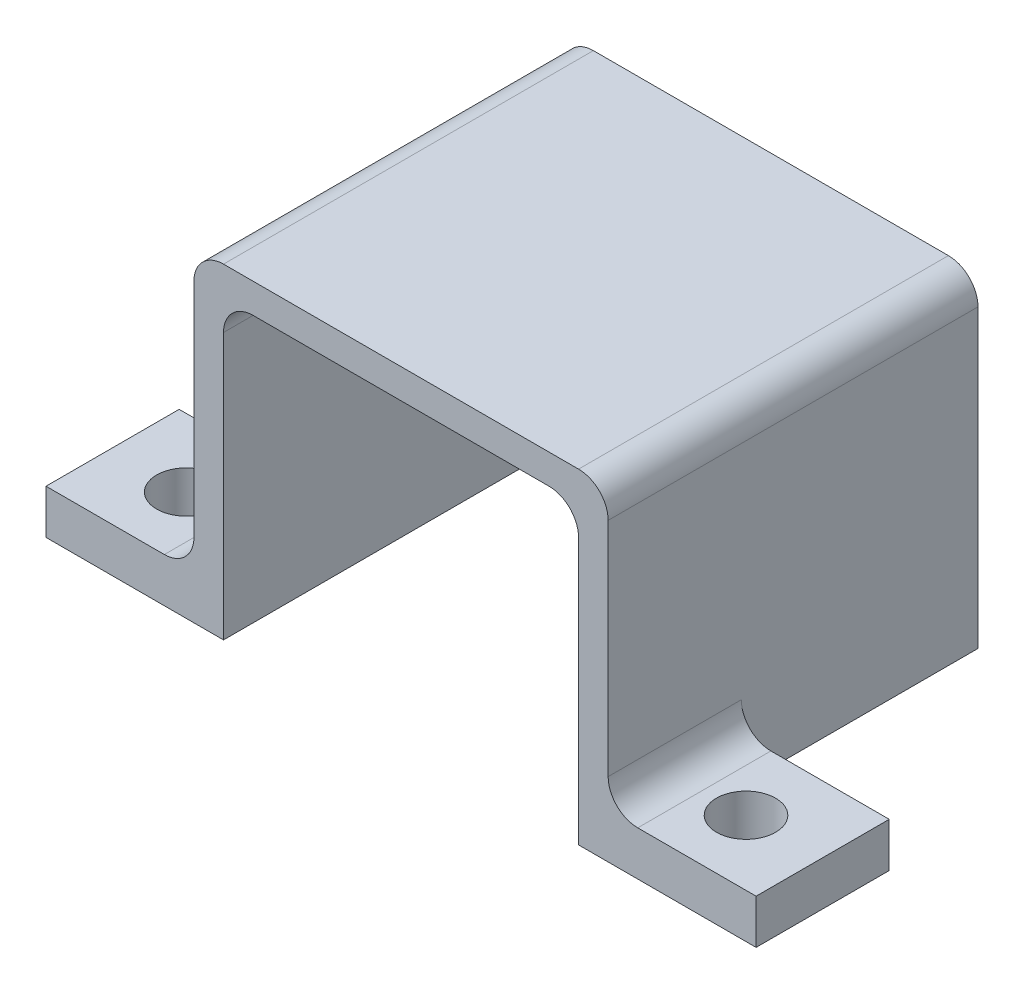
ISO-10303-21;
HEADER;
FILE_DESCRIPTION(('STEP AP214'),'2;1');
FILE_NAME('part.step','',(''),(''),'','','');
FILE_SCHEMA(('AUTOMOTIVE_DESIGN { 1 0 10303 214 1 1 1 1 }'));
ENDSEC;
DATA;
#1=APPLICATION_CONTEXT('core data for automotive mechanical design processes');
#2=APPLICATION_PROTOCOL_DEFINITION('international standard','automotive_design',2000,#1);
#3=PRODUCT_CONTEXT('',#1,'mechanical');
#4=PRODUCT('Part','Part','',(#3));
#5=PRODUCT_RELATED_PRODUCT_CATEGORY('part','',(#4));
#6=PRODUCT_DEFINITION_FORMATION('','',#4);
#7=PRODUCT_DEFINITION_CONTEXT('part definition',#1,'design');
#8=PRODUCT_DEFINITION('design','',#6,#7);
#9=PRODUCT_DEFINITION_SHAPE('','',#8);
#10=(LENGTH_UNIT() NAMED_UNIT(*) SI_UNIT(.MILLI.,.METRE.));
#11=(NAMED_UNIT(*) PLANE_ANGLE_UNIT() SI_UNIT($,.RADIAN.));
#12=(NAMED_UNIT(*) SI_UNIT($,.STERADIAN.) SOLID_ANGLE_UNIT());
#13=UNCERTAINTY_MEASURE_WITH_UNIT(LENGTH_MEASURE(1.E-05),#10,'distance_accuracy_value','');
#14=(GEOMETRIC_REPRESENTATION_CONTEXT(3) GLOBAL_UNCERTAINTY_ASSIGNED_CONTEXT((#13)) GLOBAL_UNIT_ASSIGNED_CONTEXT((#10,
#11,#12)) REPRESENTATION_CONTEXT('',''));
#15=CARTESIAN_POINT('',(0.,0.,0.));
#16=DIRECTION('',(0.,0.,1.));
#17=DIRECTION('',(1.,0.,0.));
#18=AXIS2_PLACEMENT_3D('',#15,#16,#17);
#19=CARTESIAN_POINT('',(0.,24.2221183459129,0.));
#20=DIRECTION('',(0.,1.,0.));
#21=DIRECTION('',(0.,0.,1.));
#22=AXIS2_PLACEMENT_3D('',#19,#20,#21);
#23=PLANE('',#22);
#24=DIRECTION('',(1.,0.,0.));
#25=VECTOR('',#24,1.);
#26=CARTESIAN_POINT('',(8.51904319018354,24.2221183459129,28.3904073622046));
#27=LINE('',#26,#25);
#28=CARTESIAN_POINT('',(8.51904319018354,24.2221183459129,28.3904073622046));
#29=VERTEX_POINT('',#28);
#30=CARTESIAN_POINT('',(17.1865680248929,24.2221183459129,28.3904073622046));
#31=VERTEX_POINT('',#30);
#32=EDGE_CURVE('E429',#29,#31,#27,.T.);
#33=ORIENTED_EDGE('',*,*,#32,.T.);
#34=DIRECTION('',(0.,0.,1.));
#35=VECTOR('',#34,1.);
#36=CARTESIAN_POINT('',(17.1865680248929,24.2221183459129,29.5904073622046));
#37=LINE('',#36,#35);
#38=CARTESIAN_POINT('',(17.1865680248929,24.2221183459129,30.7904073622046));
#39=VERTEX_POINT('',#38);
#40=EDGE_CURVE('E287',#31,#39,#37,.T.);
#41=ORIENTED_EDGE('',*,*,#40,.T.);
#42=DIRECTION('',(-1.,0.,0.));
#43=VECTOR('',#42,1.);
#44=CARTESIAN_POINT('',(8.51904319018354,24.2221183459129,30.7904073622046));
#45=LINE('',#44,#43);
#46=CARTESIAN_POINT('',(8.51904319018354,24.2221183459129,30.7904073622046));
#47=VERTEX_POINT('',#46);
#48=EDGE_CURVE('E435',#39,#47,#45,.T.);
#49=ORIENTED_EDGE('',*,*,#48,.T.);
#50=DIRECTION('',(0.,0.,-1.));
#51=VECTOR('',#50,1.);
#52=CARTESIAN_POINT('',(8.51904319018354,24.2221183459129,28.3904073622046));
#53=LINE('',#52,#51);
#54=EDGE_CURVE('E424',#47,#29,#53,.T.);
#55=ORIENTED_EDGE('',*,*,#54,.T.);
#56=EDGE_LOOP('',(#33,#41,#49,#55));
#57=FACE_BOUND('',#56,.T.);
#58=ADVANCED_FACE('F38',(#57),#23,.F.);
#59=CARTESIAN_POINT('',(8.51904319018354,25.2221183459129,1.18964979731646));
#60=DIRECTION('',(0.,-1.,0.));
#61=DIRECTION('',(0.,0.,-1.));
#62=AXIS2_PLACEMENT_3D('',#59,#60,#61);
#63=PLANE('',#62);
#64=DIRECTION('',(0.,0.,1.));
#65=VECTOR('',#64,1.);
#66=CARTESIAN_POINT('',(9.51904319018354,25.2221183459129,27.5904073622046));
#67=LINE('',#66,#65);
#68=CARTESIAN_POINT('',(9.51904319018354,25.2221183459129,28.3904073622046));
#69=VERTEX_POINT('',#68);
#70=CARTESIAN_POINT('',(9.51904319018354,25.2221183459129,27.5904073622046));
#71=VERTEX_POINT('',#70);
#72=EDGE_CURVE('E256',#69,#71,#67,.F.);
#73=ORIENTED_EDGE('',*,*,#72,.T.);
#74=DIRECTION('',(-1.,0.,0.));
#75=VECTOR('',#74,1.);
#76=CARTESIAN_POINT('',(8.51904319018354,25.2221183459129,27.5904073622046));
#77=LINE('',#76,#75);
#78=CARTESIAN_POINT('',(19.5190431901835,25.2221183459129,27.5904073622046));
#79=VERTEX_POINT('',#78);
#80=EDGE_CURVE('E237',#79,#71,#77,.T.);
#81=ORIENTED_EDGE('',*,*,#80,.F.);
#82=DIRECTION('',(0.,0.,1.));
#83=VECTOR('',#82,1.);
#84=CARTESIAN_POINT('',(19.5190431901835,25.2221183459129,40.0904073622046));
#85=LINE('',#84,#83);
#86=CARTESIAN_POINT('',(19.5190431901835,25.2221183459129,28.3904073622046));
#87=VERTEX_POINT('',#86);
#88=EDGE_CURVE('E261',#79,#87,#85,.T.);
#89=ORIENTED_EDGE('',*,*,#88,.T.);
#90=DIRECTION('',(1.,0.,0.));
#91=VECTOR('',#90,1.);
#92=CARTESIAN_POINT('',(8.51904319018354,25.2221183459129,28.3904073622046));
#93=LINE('',#92,#91);
#94=EDGE_CURVE('E423',#69,#87,#93,.T.);
#95=ORIENTED_EDGE('',*,*,#94,.F.);
#96=EDGE_LOOP('',(#73,#81,#89,#95));
#97=FACE_BOUND('',#96,.T.);
#98=ADVANCED_FACE('F470',(#97),#63,.T.);
#99=CARTESIAN_POINT('',(19.5190431901835,25.2221183459129,30.7904073622046));
#100=VERTEX_POINT('',#99);
#101=CARTESIAN_POINT('',(19.5190431901835,25.2221183459129,40.0904073622046));
#102=VERTEX_POINT('',#101);
#103=EDGE_CURVE('E260',#100,#102,#85,.T.);
#104=ORIENTED_EDGE('',*,*,#103,.T.);
#105=DIRECTION('',(1.,0.,0.));
#106=VECTOR('',#105,1.);
#107=CARTESIAN_POINT('',(8.51904319018354,25.2221183459129,40.0904073622046));
#108=LINE('',#107,#106);
#109=CARTESIAN_POINT('',(9.51904319018354,25.2221183459129,40.0904073622046));
#110=VERTEX_POINT('',#109);
#111=EDGE_CURVE('E353',#110,#102,#108,.T.);
#112=ORIENTED_EDGE('',*,*,#111,.F.);
#113=CARTESIAN_POINT('',(9.51904319018354,25.2221183459129,30.7904073622046));
#114=VERTEX_POINT('',#113);
#115=EDGE_CURVE('E258',#110,#114,#67,.F.);
#116=ORIENTED_EDGE('',*,*,#115,.T.);
#117=DIRECTION('',(-1.,0.,0.));
#118=VECTOR('',#117,1.);
#119=CARTESIAN_POINT('',(8.51904319018354,25.2221183459129,30.7904073622046));
#120=LINE('',#119,#118);
#121=EDGE_CURVE('E428',#100,#114,#120,.T.);
#122=ORIENTED_EDGE('',*,*,#121,.F.);
#123=EDGE_LOOP('',(#104,#112,#116,#122));
#124=FACE_BOUND('',#123,.T.);
#125=ADVANCED_FACE('F491',(#124),#63,.T.);
#126=CARTESIAN_POINT('',(19.5190431901835,24.2221183459129,1.18964979731646));
#127=DIRECTION('',(0.,0.,-1.));
#128=DIRECTION('',(-1.,0.,0.));
#129=AXIS2_PLACEMENT_3D('',#126,#127,#128);
#130=CYLINDRICAL_SURFACE('',#129,1.);
#131=CARTESIAN_POINT('',(19.5190431901835,24.2221183459129,28.3904073622046));
#132=DIRECTION('',(0.,0.,1.));
#133=DIRECTION('',(1.,0.,0.));
#134=AXIS2_PLACEMENT_3D('',#131,#132,#133);
#135=CIRCLE('',#134,1.);
#136=CARTESIAN_POINT('',(20.5190431901835,24.2221183459129,28.3904073622046));
#137=VERTEX_POINT('',#136);
#138=EDGE_CURVE('E444',#87,#137,#135,.F.);
#139=ORIENTED_EDGE('',*,*,#138,.F.);
#140=ORIENTED_EDGE('',*,*,#88,.F.);
#141=CARTESIAN_POINT('',(19.5190431901835,24.2221183459129,27.5904073622046));
#142=DIRECTION('',(0.,0.,1.));
#143=DIRECTION('',(1.,0.,0.));
#144=AXIS2_PLACEMENT_3D('',#141,#142,#143);
#145=CIRCLE('',#144,1.);
#146=CARTESIAN_POINT('',(20.5190431901835,24.2221183459129,27.5904073622046));
#147=VERTEX_POINT('',#146);
#148=EDGE_CURVE('E273',#147,#79,#145,.T.);
#149=ORIENTED_EDGE('',*,*,#148,.F.);
#150=DIRECTION('',(0.,0.,1.));
#151=VECTOR('',#150,1.);
#152=CARTESIAN_POINT('',(20.5190431901835,24.2221183459129,27.5904073622046));
#153=LINE('',#152,#151);
#154=EDGE_CURVE('E264',#137,#147,#153,.F.);
#155=ORIENTED_EDGE('',*,*,#154,.F.);
#156=EDGE_LOOP('',(#139,#140,#149,#155));
#157=FACE_BOUND('',#156,.T.);
#158=ADVANCED_FACE('F466',(#157),#130,.F.);
#159=CARTESIAN_POINT('',(19.5190431901835,24.2221183459129,30.7904073622046));
#160=DIRECTION('',(0.,0.,-1.));
#161=DIRECTION('',(-1.,0.,0.));
#162=AXIS2_PLACEMENT_3D('',#159,#160,#161);
#163=CIRCLE('',#162,1.);
#164=CARTESIAN_POINT('',(20.5190431901835,24.2221183459129,30.7904073622046));
#165=VERTEX_POINT('',#164);
#166=EDGE_CURVE('E439',#165,#100,#163,.F.);
#167=ORIENTED_EDGE('',*,*,#166,.F.);
#168=CARTESIAN_POINT('',(20.5190431901835,24.2221183459129,40.0904073622046));
#169=VERTEX_POINT('',#168);
#170=EDGE_CURVE('E265',#169,#165,#153,.F.);
#171=ORIENTED_EDGE('',*,*,#170,.F.);
#172=CARTESIAN_POINT('',(19.5190431901835,24.2221183459129,40.0904073622046));
#173=DIRECTION('',(0.,0.,1.));
#174=DIRECTION('',(1.,0.,0.));
#175=AXIS2_PLACEMENT_3D('',#172,#173,#174);
#176=CIRCLE('',#175,1.);
#177=EDGE_CURVE('E271',#102,#169,#176,.F.);
#178=ORIENTED_EDGE('',*,*,#177,.F.);
#179=ORIENTED_EDGE('',*,*,#103,.F.);
#180=EDGE_LOOP('',(#167,#171,#178,#179));
#181=FACE_BOUND('',#180,.T.);
#182=ADVANCED_FACE('F497',(#181),#130,.F.);
#183=CARTESIAN_POINT('',(9.51904319018354,24.2221183459129,1.18964979731646));
#184=DIRECTION('',(0.,0.,-1.));
#185=DIRECTION('',(-1.,0.,0.));
#186=AXIS2_PLACEMENT_3D('',#183,#184,#185);
#187=CYLINDRICAL_SURFACE('',#186,1.);
#188=CARTESIAN_POINT('',(9.51904319018354,24.2221183459129,28.3904073622046));
#189=DIRECTION('',(0.,0.,1.));
#190=DIRECTION('',(1.,0.,0.));
#191=AXIS2_PLACEMENT_3D('',#188,#189,#190);
#192=CIRCLE('',#191,1.);
#193=EDGE_CURVE('E282',#29,#69,#192,.F.);
#194=ORIENTED_EDGE('',*,*,#193,.F.);
#195=DIRECTION('',(0.,0.,1.));
#196=VECTOR('',#195,1.);
#197=CARTESIAN_POINT('',(8.51904319018354,24.2221183459129,40.0904073622046));
#198=LINE('',#197,#196);
#199=CARTESIAN_POINT('',(8.51904319018354,24.2221183459129,27.5904073622046));
#200=VERTEX_POINT('',#199);
#201=EDGE_CURVE('E268',#200,#29,#198,.T.);
#202=ORIENTED_EDGE('',*,*,#201,.F.);
#203=CARTESIAN_POINT('',(9.51904319018354,24.2221183459129,27.5904073622046));
#204=DIRECTION('',(0.,0.,1.));
#205=DIRECTION('',(1.,0.,0.));
#206=AXIS2_PLACEMENT_3D('',#203,#204,#205);
#207=CIRCLE('',#206,1.);
#208=EDGE_CURVE('E277',#71,#200,#207,.T.);
#209=ORIENTED_EDGE('',*,*,#208,.F.);
#210=ORIENTED_EDGE('',*,*,#72,.F.);
#211=EDGE_LOOP('',(#194,#202,#209,#210));
#212=FACE_BOUND('',#211,.T.);
#213=ADVANCED_FACE('F476',(#212),#187,.F.);
#214=CARTESIAN_POINT('',(9.51904319018354,24.2221183459129,30.7904073622046));
#215=DIRECTION('',(0.,0.,-1.));
#216=DIRECTION('',(-1.,0.,0.));
#217=AXIS2_PLACEMENT_3D('',#214,#215,#216);
#218=CIRCLE('',#217,1.);
#219=EDGE_CURVE('E279',#114,#47,#218,.F.);
#220=ORIENTED_EDGE('',*,*,#219,.F.);
#221=ORIENTED_EDGE('',*,*,#115,.F.);
#222=CARTESIAN_POINT('',(9.51904319018354,24.2221183459129,40.0904073622046));
#223=DIRECTION('',(0.,0.,1.));
#224=DIRECTION('',(1.,0.,0.));
#225=AXIS2_PLACEMENT_3D('',#222,#223,#224);
#226=CIRCLE('',#225,1.);
#227=CARTESIAN_POINT('',(8.51904319018354,24.2221183459129,40.0904073622046));
#228=VERTEX_POINT('',#227);
#229=EDGE_CURVE('E275',#228,#110,#226,.F.);
#230=ORIENTED_EDGE('',*,*,#229,.F.);
#231=EDGE_CURVE('E267',#47,#228,#198,.T.);
#232=ORIENTED_EDGE('',*,*,#231,.F.);
#233=EDGE_LOOP('',(#220,#221,#230,#232));
#234=FACE_BOUND('',#233,.T.);
#235=ADVANCED_FACE('F488',(#234),#187,.F.);
#236=CARTESIAN_POINT('',(7.51904319018354,15.2221183459129,1.18964979731646));
#237=DIRECTION('',(0.,-1.,0.));
#238=DIRECTION('',(0.,0.,-1.));
#239=AXIS2_PLACEMENT_3D('',#236,#237,#238);
#240=PLANE('',#239);
#241=DIRECTION('',(0.,0.,-1.));
#242=VECTOR('',#241,1.);
#243=CARTESIAN_POINT('',(7.51904319018354,15.2221183459129,27.5904073622046));
#244=LINE('',#243,#242);
#245=CARTESIAN_POINT('',(7.51904319018354,15.2221183459129,35.5904073622046));
#246=VERTEX_POINT('',#245);
#247=CARTESIAN_POINT('',(7.51904319018354,15.2221183459129,27.5904073622046));
#248=VERTEX_POINT('',#247);
#249=EDGE_CURVE('E220',#246,#248,#244,.T.);
#250=ORIENTED_EDGE('',*,*,#249,.T.);
#251=DIRECTION('',(-1.,0.,0.));
#252=VECTOR('',#251,1.);
#253=CARTESIAN_POINT('',(7.51904319018354,15.2221183459129,27.5904073622046));
#254=LINE('',#253,#252);
#255=CARTESIAN_POINT('',(8.51904319018354,15.2221183459129,27.5904073622046));
#256=VERTEX_POINT('',#255);
#257=EDGE_CURVE('E257',#256,#248,#254,.T.);
#258=ORIENTED_EDGE('',*,*,#257,.F.);
#259=DIRECTION('',(0.,0.,1.));
#260=VECTOR('',#259,1.);
#261=CARTESIAN_POINT('',(8.51904319018354,15.2221183459129,1.18964979731646));
#262=LINE('',#261,#260);
#263=CARTESIAN_POINT('',(8.51904319018354,15.2221183459129,40.0904073622046));
#264=VERTEX_POINT('',#263);
#265=EDGE_CURVE('E252',#256,#264,#262,.T.);
#266=ORIENTED_EDGE('',*,*,#265,.T.);
#267=DIRECTION('',(1.,0.,0.));
#268=VECTOR('',#267,1.);
#269=CARTESIAN_POINT('',(7.51904319018354,15.2221183459129,40.0904073622046));
#270=LINE('',#269,#268);
#271=CARTESIAN_POINT('',(2.51904319018354,15.2221183459129,40.0904073622046));
#272=VERTEX_POINT('',#271);
#273=EDGE_CURVE('E236',#272,#264,#270,.T.);
#274=ORIENTED_EDGE('',*,*,#273,.F.);
#275=DIRECTION('',(0.,0.,1.));
#276=VECTOR('',#275,1.);
#277=CARTESIAN_POINT('',(2.51904319018354,15.2221183459129,1.18964979731646));
#278=LINE('',#277,#276);
#279=CARTESIAN_POINT('',(2.51904319018354,15.2221183459129,35.5904073622046));
#280=VERTEX_POINT('',#279);
#281=EDGE_CURVE('E227',#280,#272,#278,.T.);
#282=ORIENTED_EDGE('',*,*,#281,.F.);
#283=DIRECTION('',(1.,0.,0.));
#284=VECTOR('',#283,1.);
#285=CARTESIAN_POINT('',(2.51904319018354,15.2221183459129,35.5904073622046));
#286=LINE('',#285,#284);
#287=EDGE_CURVE('E208',#280,#246,#286,.T.);
#288=ORIENTED_EDGE('',*,*,#287,.T.);
#289=EDGE_LOOP('',(#250,#258,#266,#274,#282,#288));
#290=FACE_BOUND('',#289,.T.);
#291=CARTESIAN_POINT('',(5.05904319018353,15.2221183459129,37.8913308205044));
#292=DIRECTION('',(0.,1.,0.));
#293=DIRECTION('',(0.,0.,1.));
#294=AXIS2_PLACEMENT_3D('',#291,#292,#293);
#295=CIRCLE('',#294,1.);
#296=CARTESIAN_POINT('',(5.05904319018353,15.2221183459129,38.8913308205044));
#297=VERTEX_POINT('',#296);
#298=EDGE_CURVE('E354',#297,#297,#295,.T.);
#299=ORIENTED_EDGE('',*,*,#298,.T.);
#300=EDGE_LOOP('',(#299));
#301=FACE_BOUND('',#300,.T.);
#302=ADVANCED_FACE('F233',(#290,#301),#240,.T.);
#303=CARTESIAN_POINT('',(2.51904319018354,15.2221183459129,1.18964979731646));
#304=DIRECTION('',(-1.,0.,0.));
#305=DIRECTION('',(0.,0.,1.));
#306=AXIS2_PLACEMENT_3D('',#303,#304,#305);
#307=PLANE('',#306);
#308=DIRECTION('',(0.,1.,0.));
#309=VECTOR('',#308,1.);
#310=CARTESIAN_POINT('',(2.51904319018354,15.2221183459129,35.5904073622046));
#311=LINE('',#310,#309);
#312=CARTESIAN_POINT('',(2.51904319018354,16.7221183459129,35.5904073622046));
#313=VERTEX_POINT('',#312);
#314=EDGE_CURVE('E212',#280,#313,#311,.T.);
#315=ORIENTED_EDGE('',*,*,#314,.F.);
#316=ORIENTED_EDGE('',*,*,#281,.T.);
#317=DIRECTION('',(0.,-1.,0.));
#318=VECTOR('',#317,1.);
#319=CARTESIAN_POINT('',(2.51904319018354,15.2221183459129,40.0904073622046));
#320=LINE('',#319,#318);
#321=CARTESIAN_POINT('',(2.51904319018354,16.7221183459129,40.0904073622046));
#322=VERTEX_POINT('',#321);
#323=EDGE_CURVE('E338',#322,#272,#320,.T.);
#324=ORIENTED_EDGE('',*,*,#323,.F.);
#325=DIRECTION('',(0.,0.,1.));
#326=VECTOR('',#325,1.);
#327=CARTESIAN_POINT('',(2.51904319018354,16.7221183459129,1.18964979731646));
#328=LINE('',#327,#326);
#329=EDGE_CURVE('E230',#313,#322,#328,.T.);
#330=ORIENTED_EDGE('',*,*,#329,.F.);
#331=EDGE_LOOP('',(#315,#316,#324,#330));
#332=FACE_BOUND('',#331,.T.);
#333=ADVANCED_FACE('F225',(#332),#307,.T.);
#334=CARTESIAN_POINT('',(7.51904319018354,16.7221183459129,1.18964979731646));
#335=DIRECTION('',(0.,1.,0.));
#336=DIRECTION('',(0.,0.,1.));
#337=AXIS2_PLACEMENT_3D('',#334,#335,#336);
#338=PLANE('',#337);
#339=DIRECTION('',(-1.,0.,0.));
#340=VECTOR('',#339,1.);
#341=CARTESIAN_POINT('',(7.51904319018354,16.7221183459129,40.0904073622046));
#342=LINE('',#341,#340);
#343=CARTESIAN_POINT('',(6.51904319018354,16.7221183459129,40.0904073622046));
#344=VERTEX_POINT('',#343);
#345=EDGE_CURVE('E335',#344,#322,#342,.T.);
#346=ORIENTED_EDGE('',*,*,#345,.F.);
#347=DIRECTION('',(0.,0.,1.));
#348=VECTOR('',#347,1.);
#349=CARTESIAN_POINT('',(6.51904319018354,16.7221183459129,35.5904073622046));
#350=LINE('',#349,#348);
#351=CARTESIAN_POINT('',(6.51904319018354,16.7221183459129,35.5904073622046));
#352=VERTEX_POINT('',#351);
#353=EDGE_CURVE('E311',#344,#352,#350,.F.);
#354=ORIENTED_EDGE('',*,*,#353,.T.);
#355=DIRECTION('',(1.,0.,0.));
#356=VECTOR('',#355,1.);
#357=CARTESIAN_POINT('',(2.51904319018354,16.7221183459129,35.5904073622046));
#358=LINE('',#357,#356);
#359=EDGE_CURVE('E221',#313,#352,#358,.T.);
#360=ORIENTED_EDGE('',*,*,#359,.F.);
#361=ORIENTED_EDGE('',*,*,#329,.T.);
#362=EDGE_LOOP('',(#346,#354,#360,#361));
#363=FACE_BOUND('',#362,.T.);
#364=CARTESIAN_POINT('',(5.05904319018353,16.7221183459129,37.8913308205044));
#365=DIRECTION('',(0.,1.,0.));
#366=DIRECTION('',(0.,0.,1.));
#367=AXIS2_PLACEMENT_3D('',#364,#365,#366);
#368=CIRCLE('',#367,1.);
#369=CARTESIAN_POINT('',(5.05904319018353,16.7221183459129,38.8913308205044));
#370=VERTEX_POINT('',#369);
#371=EDGE_CURVE('E360',#370,#370,#368,.T.);
#372=ORIENTED_EDGE('',*,*,#371,.F.);
#373=EDGE_LOOP('',(#372));
#374=FACE_BOUND('',#373,.T.);
#375=ADVANCED_FACE('F566',(#363,#374),#338,.T.);
#376=CARTESIAN_POINT('',(7.51904319018354,16.7221183459129,1.18964979731646));
#377=DIRECTION('',(-1.,0.,0.));
#378=DIRECTION('',(0.,0.,1.));
#379=AXIS2_PLACEMENT_3D('',#376,#377,#378);
#380=PLANE('',#379);
#381=DIRECTION('',(0.,1.,0.));
#382=VECTOR('',#381,1.);
#383=CARTESIAN_POINT('',(7.51904319018354,15.2221183459129,35.5904073622046));
#384=LINE('',#383,#382);
#385=CARTESIAN_POINT('',(7.51904319018354,17.7221183459129,35.5904073622046));
#386=VERTEX_POINT('',#385);
#387=EDGE_CURVE('E215',#246,#386,#384,.T.);
#388=ORIENTED_EDGE('',*,*,#387,.T.);
#389=DIRECTION('',(0.,0.,1.));
#390=VECTOR('',#389,1.);
#391=CARTESIAN_POINT('',(7.51904319018354,17.7221183459129,40.0904073622046));
#392=LINE('',#391,#390);
#393=CARTESIAN_POINT('',(7.51904319018354,17.7221183459129,40.0904073622046));
#394=VERTEX_POINT('',#393);
#395=EDGE_CURVE('E308',#386,#394,#392,.T.);
#396=ORIENTED_EDGE('',*,*,#395,.T.);
#397=DIRECTION('',(0.,-1.,0.));
#398=VECTOR('',#397,1.);
#399=CARTESIAN_POINT('',(7.51904319018354,16.7221183459129,40.0904073622046));
#400=LINE('',#399,#398);
#401=CARTESIAN_POINT('',(7.51904319018354,25.2221183459129,40.0904073622046));
#402=VERTEX_POINT('',#401);
#403=EDGE_CURVE('E330',#402,#394,#400,.T.);
#404=ORIENTED_EDGE('',*,*,#403,.F.);
#405=DIRECTION('',(0.,0.,1.));
#406=VECTOR('',#405,1.);
#407=CARTESIAN_POINT('',(7.51904319018354,25.2221183459129,1.18964979731646));
#408=LINE('',#407,#406);
#409=CARTESIAN_POINT('',(7.51904319018354,25.2221183459129,27.5904073622046));
#410=VERTEX_POINT('',#409);
#411=EDGE_CURVE('E306',#402,#410,#408,.F.);
#412=ORIENTED_EDGE('',*,*,#411,.T.);
#413=DIRECTION('',(0.,1.,0.));
#414=VECTOR('',#413,1.);
#415=CARTESIAN_POINT('',(7.51904319018354,16.7221183459129,27.5904073622046));
#416=LINE('',#415,#414);
#417=EDGE_CURVE('E394',#248,#410,#416,.T.);
#418=ORIENTED_EDGE('',*,*,#417,.F.);
#419=ORIENTED_EDGE('',*,*,#249,.F.);
#420=EDGE_LOOP('',(#388,#396,#404,#412,#418,#419));
#421=FACE_BOUND('',#420,.T.);
#422=ADVANCED_FACE('F329',(#421),#380,.T.);
#423=CARTESIAN_POINT('',(7.51904319018354,26.2221183459129,1.18964979731646));
#424=DIRECTION('',(0.,1.,0.));
#425=DIRECTION('',(0.,0.,1.));
#426=AXIS2_PLACEMENT_3D('',#423,#424,#425);
#427=PLANE('',#426);
#428=DIRECTION('',(-1.,0.,0.));
#429=VECTOR('',#428,1.);
#430=CARTESIAN_POINT('',(7.51904319018354,26.2221183459129,40.0904073622046));
#431=LINE('',#430,#429);
#432=CARTESIAN_POINT('',(20.5190431901835,26.2221183459129,40.0904073622046));
#433=VERTEX_POINT('',#432);
#434=CARTESIAN_POINT('',(8.51904319018354,26.2221183459129,40.0904073622046));
#435=VERTEX_POINT('',#434);
#436=EDGE_CURVE('E336',#433,#435,#431,.T.);
#437=ORIENTED_EDGE('',*,*,#436,.F.);
#438=DIRECTION('',(0.,0.,1.));
#439=VECTOR('',#438,1.);
#440=CARTESIAN_POINT('',(20.5190431901835,26.2221183459129,1.18964979731646));
#441=LINE('',#440,#439);
#442=CARTESIAN_POINT('',(20.5190431901835,26.2221183459129,27.5904073622046));
#443=VERTEX_POINT('',#442);
#444=EDGE_CURVE('E300',#433,#443,#441,.F.);
#445=ORIENTED_EDGE('',*,*,#444,.T.);
#446=DIRECTION('',(1.,0.,0.));
#447=VECTOR('',#446,1.);
#448=CARTESIAN_POINT('',(7.51904319018354,26.2221183459129,27.5904073622046));
#449=LINE('',#448,#447);
#450=CARTESIAN_POINT('',(8.51904319018354,26.2221183459129,27.5904073622046));
#451=VERTEX_POINT('',#450);
#452=EDGE_CURVE('E390',#451,#443,#449,.T.);
#453=ORIENTED_EDGE('',*,*,#452,.F.);
#454=DIRECTION('',(0.,0.,1.));
#455=VECTOR('',#454,1.);
#456=CARTESIAN_POINT('',(8.51904319018354,26.2221183459129,1.18964979731646));
#457=LINE('',#456,#455);
#458=EDGE_CURVE('E297',#451,#435,#457,.T.);
#459=ORIENTED_EDGE('',*,*,#458,.T.);
#460=EDGE_LOOP('',(#437,#445,#453,#459));
#461=FACE_BOUND('',#460,.T.);
#462=ADVANCED_FACE('F572',(#461),#427,.T.);
#463=CARTESIAN_POINT('',(21.5190431901835,26.2221183459129,1.18964979731646));
#464=DIRECTION('',(1.,0.,0.));
#465=DIRECTION('',(0.,0.,-1.));
#466=AXIS2_PLACEMENT_3D('',#463,#464,#465);
#467=PLANE('',#466);
#468=DIRECTION('',(0.,1.,0.));
#469=VECTOR('',#468,1.);
#470=CARTESIAN_POINT('',(21.5190431901835,26.2221183459129,40.0904073622046));
#471=LINE('',#470,#469);
#472=CARTESIAN_POINT('',(21.5190431901835,17.7221183459129,40.0904073622046));
#473=VERTEX_POINT('',#472);
#474=CARTESIAN_POINT('',(21.5190431901835,25.2221183459129,40.0904073622046));
#475=VERTEX_POINT('',#474);
#476=EDGE_CURVE('E340',#473,#475,#471,.T.);
#477=ORIENTED_EDGE('',*,*,#476,.F.);
#478=DIRECTION('',(0.,0.,1.));
#479=VECTOR('',#478,1.);
#480=CARTESIAN_POINT('',(21.5190431901835,17.7221183459129,35.5904073622046));
#481=LINE('',#480,#479);
#482=CARTESIAN_POINT('',(21.5190431901835,17.7221183459129,35.5904073622046));
#483=VERTEX_POINT('',#482);
#484=EDGE_CURVE('E316',#473,#483,#481,.F.);
#485=ORIENTED_EDGE('',*,*,#484,.T.);
#486=DIRECTION('',(0.,1.,0.));
#487=VECTOR('',#486,1.);
#488=CARTESIAN_POINT('',(21.5190431901835,15.2221183459129,35.5904073622046));
#489=LINE('',#488,#487);
#490=CARTESIAN_POINT('',(21.5190431901835,15.2221183459129,35.5904073622046));
#491=VERTEX_POINT('',#490);
#492=EDGE_CURVE('E52',#491,#483,#489,.T.);
#493=ORIENTED_EDGE('',*,*,#492,.F.);
#494=DIRECTION('',(0.,0.,1.));
#495=VECTOR('',#494,1.);
#496=CARTESIAN_POINT('',(21.5190431901835,15.2221183459129,27.5904073622046));
#497=LINE('',#496,#495);
#498=CARTESIAN_POINT('',(21.5190431901835,15.2221183459129,27.5904073622046));
#499=VERTEX_POINT('',#498);
#500=EDGE_CURVE('E387',#499,#491,#497,.T.);
#501=ORIENTED_EDGE('',*,*,#500,.F.);
#502=DIRECTION('',(0.,-1.,0.));
#503=VECTOR('',#502,1.);
#504=CARTESIAN_POINT('',(21.5190431901835,26.2221183459129,27.5904073622046));
#505=LINE('',#504,#503);
#506=CARTESIAN_POINT('',(21.5190431901835,25.2221183459129,27.5904073622046));
#507=VERTEX_POINT('',#506);
#508=EDGE_CURVE('E385',#507,#499,#505,.T.);
#509=ORIENTED_EDGE('',*,*,#508,.F.);
#510=DIRECTION('',(0.,0.,1.));
#511=VECTOR('',#510,1.);
#512=CARTESIAN_POINT('',(21.5190431901835,25.2221183459129,1.18964979731646));
#513=LINE('',#512,#511);
#514=EDGE_CURVE('E290',#507,#475,#513,.T.);
#515=ORIENTED_EDGE('',*,*,#514,.T.);
#516=EDGE_LOOP('',(#477,#485,#493,#501,#509,#515));
#517=FACE_BOUND('',#516,.T.);
#518=ADVANCED_FACE('F383',(#517),#467,.T.);
#519=CARTESIAN_POINT('',(21.5190431901835,16.7221183459129,1.18964979731646));
#520=DIRECTION('',(0.,1.,0.));
#521=DIRECTION('',(-1.,0.,0.));
#522=AXIS2_PLACEMENT_3D('',#519,#520,#521);
#523=PLANE('',#522);
#524=DIRECTION('',(1.,0.,0.));
#525=VECTOR('',#524,1.);
#526=CARTESIAN_POINT('',(26.5190431901835,16.7221183459129,35.5904073622046));
#527=LINE('',#526,#525);
#528=CARTESIAN_POINT('',(22.5190431901835,16.7221183459129,35.5904073622046));
#529=VERTEX_POINT('',#528);
#530=CARTESIAN_POINT('',(26.5190431901835,16.7221183459129,35.5904073622046));
#531=VERTEX_POINT('',#530);
#532=EDGE_CURVE('E411',#529,#531,#527,.T.);
#533=ORIENTED_EDGE('',*,*,#532,.F.);
#534=DIRECTION('',(0.,0.,1.));
#535=VECTOR('',#534,1.);
#536=CARTESIAN_POINT('',(22.5190431901835,16.7221183459129,40.0904073622046));
#537=LINE('',#536,#535);
#538=CARTESIAN_POINT('',(22.5190431901835,16.7221183459129,40.0904073622046));
#539=VERTEX_POINT('',#538);
#540=EDGE_CURVE('E313',#529,#539,#537,.T.);
#541=ORIENTED_EDGE('',*,*,#540,.T.);
#542=DIRECTION('',(-1.,0.,0.));
#543=VECTOR('',#542,1.);
#544=CARTESIAN_POINT('',(21.5190431901835,16.7221183459129,40.0904073622046));
#545=LINE('',#544,#543);
#546=CARTESIAN_POINT('',(26.5190431901835,16.7221183459129,40.0904073622046));
#547=VERTEX_POINT('',#546);
#548=EDGE_CURVE('E372',#547,#539,#545,.T.);
#549=ORIENTED_EDGE('',*,*,#548,.F.);
#550=DIRECTION('',(0.,0.,1.));
#551=VECTOR('',#550,1.);
#552=CARTESIAN_POINT('',(26.5190431901835,16.7221183459129,1.18964979731646));
#553=LINE('',#552,#551);
#554=EDGE_CURVE('E241',#531,#547,#553,.T.);
#555=ORIENTED_EDGE('',*,*,#554,.F.);
#556=EDGE_LOOP('',(#533,#541,#549,#555));
#557=FACE_BOUND('',#556,.T.);
#558=CARTESIAN_POINT('',(23.9790431901835,16.7221183459129,37.8913308205044));
#559=DIRECTION('',(0.,1.,0.));
#560=DIRECTION('',(0.,0.,1.));
#561=AXIS2_PLACEMENT_3D('',#558,#559,#560);
#562=CIRCLE('',#561,1.);
#563=CARTESIAN_POINT('',(23.9790431901835,16.7221183459129,38.8913308205044));
#564=VERTEX_POINT('',#563);
#565=EDGE_CURVE('E446',#564,#564,#562,.T.);
#566=ORIENTED_EDGE('',*,*,#565,.F.);
#567=EDGE_LOOP('',(#566));
#568=FACE_BOUND('',#567,.T.);
#569=ADVANCED_FACE('F511',(#557,#568),#523,.T.);
#570=CARTESIAN_POINT('',(26.5190431901835,15.2221183459129,1.18964979731646));
#571=DIRECTION('',(1.,0.,0.));
#572=DIRECTION('',(0.,0.,-1.));
#573=AXIS2_PLACEMENT_3D('',#570,#571,#572);
#574=PLANE('',#573);
#575=DIRECTION('',(0.,1.,0.));
#576=VECTOR('',#575,1.);
#577=CARTESIAN_POINT('',(26.5190431901835,15.2221183459129,35.5904073622046));
#578=LINE('',#577,#576);
#579=CARTESIAN_POINT('',(26.5190431901835,15.2221183459129,35.5904073622046));
#580=VERTEX_POINT('',#579);
#581=EDGE_CURVE('E406',#580,#531,#578,.T.);
#582=ORIENTED_EDGE('',*,*,#581,.T.);
#583=ORIENTED_EDGE('',*,*,#554,.T.);
#584=DIRECTION('',(0.,1.,0.));
#585=VECTOR('',#584,1.);
#586=CARTESIAN_POINT('',(26.5190431901835,15.2221183459129,40.0904073622046));
#587=LINE('',#586,#585);
#588=CARTESIAN_POINT('',(26.5190431901835,15.2221183459129,40.0904073622046));
#589=VERTEX_POINT('',#588);
#590=EDGE_CURVE('E369',#589,#547,#587,.T.);
#591=ORIENTED_EDGE('',*,*,#590,.F.);
#592=DIRECTION('',(0.,0.,1.));
#593=VECTOR('',#592,1.);
#594=CARTESIAN_POINT('',(26.5190431901835,15.2221183459129,1.18964979731646));
#595=LINE('',#594,#593);
#596=EDGE_CURVE('E247',#580,#589,#595,.T.);
#597=ORIENTED_EDGE('',*,*,#596,.F.);
#598=EDGE_LOOP('',(#582,#583,#591,#597));
#599=FACE_BOUND('',#598,.T.);
#600=ADVANCED_FACE('F507',(#599),#574,.T.);
#601=CARTESIAN_POINT('',(21.5190431901835,15.2221183459129,1.18964979731646));
#602=DIRECTION('',(0.,-1.,0.));
#603=DIRECTION('',(1.,0.,0.));
#604=AXIS2_PLACEMENT_3D('',#601,#602,#603);
#605=PLANE('',#604);
#606=DIRECTION('',(1.,0.,0.));
#607=VECTOR('',#606,1.);
#608=CARTESIAN_POINT('',(26.5190431901835,15.2221183459129,35.5904073622046));
#609=LINE('',#608,#607);
#610=EDGE_CURVE('E410',#491,#580,#609,.T.);
#611=ORIENTED_EDGE('',*,*,#610,.T.);
#612=ORIENTED_EDGE('',*,*,#596,.T.);
#613=DIRECTION('',(1.,0.,0.));
#614=VECTOR('',#613,1.);
#615=CARTESIAN_POINT('',(21.5190431901835,15.2221183459129,40.0904073622046));
#616=LINE('',#615,#614);
#617=CARTESIAN_POINT('',(20.5190431901835,15.2221183459129,40.0904073622046));
#618=VERTEX_POINT('',#617);
#619=EDGE_CURVE('E366',#618,#589,#616,.T.);
#620=ORIENTED_EDGE('',*,*,#619,.F.);
#621=DIRECTION('',(0.,0.,1.));
#622=VECTOR('',#621,1.);
#623=CARTESIAN_POINT('',(20.5190431901835,15.2221183459129,1.18964979731646));
#624=LINE('',#623,#622);
#625=CARTESIAN_POINT('',(20.5190431901835,15.2221183459129,27.5904073622046));
#626=VERTEX_POINT('',#625);
#627=EDGE_CURVE('E249',#626,#618,#624,.T.);
#628=ORIENTED_EDGE('',*,*,#627,.F.);
#629=DIRECTION('',(-1.,0.,0.));
#630=VECTOR('',#629,1.);
#631=CARTESIAN_POINT('',(21.5190431901835,15.2221183459129,27.5904073622046));
#632=LINE('',#631,#630);
#633=EDGE_CURVE('E391',#499,#626,#632,.T.);
#634=ORIENTED_EDGE('',*,*,#633,.F.);
#635=ORIENTED_EDGE('',*,*,#500,.T.);
#636=EDGE_LOOP('',(#611,#612,#620,#628,#634,#635));
#637=FACE_BOUND('',#636,.T.);
#638=CARTESIAN_POINT('',(23.9790431901835,15.2221183459129,37.8913308205044));
#639=DIRECTION('',(0.,1.,0.));
#640=DIRECTION('',(0.,0.,1.));
#641=AXIS2_PLACEMENT_3D('',#638,#639,#640);
#642=CIRCLE('',#641,1.);
#643=CARTESIAN_POINT('',(23.9790431901835,15.2221183459129,38.8913308205044));
#644=VERTEX_POINT('',#643);
#645=EDGE_CURVE('E450',#644,#644,#642,.T.);
#646=ORIENTED_EDGE('',*,*,#645,.T.);
#647=EDGE_LOOP('',(#646));
#648=FACE_BOUND('',#647,.T.);
#649=ADVANCED_FACE('F501',(#637,#648),#605,.T.);
#650=CARTESIAN_POINT('',(20.5190431901835,25.2221183459129,1.18964979731646));
#651=DIRECTION('',(-1.,0.,0.));
#652=DIRECTION('',(0.,0.,1.));
#653=AXIS2_PLACEMENT_3D('',#650,#651,#652);
#654=PLANE('',#653);
#655=ORIENTED_EDGE('',*,*,#170,.T.);
#656=DIRECTION('',(0.,0.,1.));
#657=VECTOR('',#656,1.);
#658=CARTESIAN_POINT('',(20.5190431901835,24.2221183459129,28.3904073622046));
#659=LINE('',#658,#657);
#660=EDGE_CURVE('E432',#137,#165,#659,.T.);
#661=ORIENTED_EDGE('',*,*,#660,.F.);
#662=ORIENTED_EDGE('',*,*,#154,.T.);
#663=DIRECTION('',(0.,1.,0.));
#664=VECTOR('',#663,1.);
#665=CARTESIAN_POINT('',(20.5190431901835,25.2221183459129,27.5904073622046));
#666=LINE('',#665,#664);
#667=EDGE_CURVE('E239',#626,#147,#666,.T.);
#668=ORIENTED_EDGE('',*,*,#667,.F.);
#669=ORIENTED_EDGE('',*,*,#627,.T.);
#670=DIRECTION('',(0.,-1.,0.));
#671=VECTOR('',#670,1.);
#672=CARTESIAN_POINT('',(20.5190431901835,25.2221183459129,40.0904073622046));
#673=LINE('',#672,#671);
#674=EDGE_CURVE('E357',#169,#618,#673,.T.);
#675=ORIENTED_EDGE('',*,*,#674,.F.);
#676=EDGE_LOOP('',(#655,#661,#662,#668,#669,#675));
#677=FACE_BOUND('',#676,.T.);
#678=ADVANCED_FACE('F462',(#677),#654,.T.);
#679=CARTESIAN_POINT('',(8.51904319018354,15.2221183459129,1.18964979731646));
#680=DIRECTION('',(1.,0.,0.));
#681=DIRECTION('',(0.,0.,-1.));
#682=AXIS2_PLACEMENT_3D('',#679,#680,#681);
#683=PLANE('',#682);
#684=ORIENTED_EDGE('',*,*,#54,.F.);
#685=ORIENTED_EDGE('',*,*,#231,.T.);
#686=DIRECTION('',(0.,1.,0.));
#687=VECTOR('',#686,1.);
#688=CARTESIAN_POINT('',(8.51904319018354,15.2221183459129,40.0904073622046));
#689=LINE('',#688,#687);
#690=EDGE_CURVE('E345',#264,#228,#689,.T.);
#691=ORIENTED_EDGE('',*,*,#690,.F.);
#692=ORIENTED_EDGE('',*,*,#265,.F.);
#693=DIRECTION('',(0.,-1.,0.));
#694=VECTOR('',#693,1.);
#695=CARTESIAN_POINT('',(8.51904319018354,15.2221183459129,27.5904073622046));
#696=LINE('',#695,#694);
#697=EDGE_CURVE('E254',#200,#256,#696,.T.);
#698=ORIENTED_EDGE('',*,*,#697,.F.);
#699=ORIENTED_EDGE('',*,*,#201,.T.);
#700=EDGE_LOOP('',(#684,#685,#691,#692,#698,#699));
#701=FACE_BOUND('',#700,.T.);
#702=ADVANCED_FACE('F350',(#701),#683,.T.);
#703=CARTESIAN_POINT('',(0.,0.,40.0904073622046));
#704=DIRECTION('',(0.,0.,1.));
#705=DIRECTION('',(1.,0.,0.));
#706=AXIS2_PLACEMENT_3D('',#703,#704,#705);
#707=PLANE('',#706);
#708=ORIENTED_EDGE('',*,*,#548,.T.);
#709=CARTESIAN_POINT('',(22.5190431901835,17.7221183459129,40.0904073622046));
#710=DIRECTION('',(0.,0.,1.));
#711=DIRECTION('',(1.,0.,0.));
#712=AXIS2_PLACEMENT_3D('',#709,#710,#711);
#713=CIRCLE('',#712,1.);
#714=EDGE_CURVE('E46',#539,#473,#713,.F.);
#715=ORIENTED_EDGE('',*,*,#714,.T.);
#716=ORIENTED_EDGE('',*,*,#476,.T.);
#717=CARTESIAN_POINT('',(20.5190431901835,25.2221183459129,40.0904073622046));
#718=DIRECTION('',(0.,0.,1.));
#719=DIRECTION('',(1.,0.,0.));
#720=AXIS2_PLACEMENT_3D('',#717,#718,#719);
#721=CIRCLE('',#720,1.);
#722=EDGE_CURVE('E295',#475,#433,#721,.T.);
#723=ORIENTED_EDGE('',*,*,#722,.T.);
#724=ORIENTED_EDGE('',*,*,#436,.T.);
#725=CARTESIAN_POINT('',(8.51904319018354,25.2221183459129,40.0904073622046));
#726=DIRECTION('',(0.,0.,1.));
#727=DIRECTION('',(1.,0.,0.));
#728=AXIS2_PLACEMENT_3D('',#725,#726,#727);
#729=CIRCLE('',#728,1.);
#730=EDGE_CURVE('E293',#435,#402,#729,.T.);
#731=ORIENTED_EDGE('',*,*,#730,.T.);
#732=ORIENTED_EDGE('',*,*,#403,.T.);
#733=CARTESIAN_POINT('',(6.51904319018354,17.7221183459129,40.0904073622046));
#734=DIRECTION('',(0.,0.,1.));
#735=DIRECTION('',(1.,0.,0.));
#736=AXIS2_PLACEMENT_3D('',#733,#734,#735);
#737=CIRCLE('',#736,1.);
#738=EDGE_CURVE('E318',#394,#344,#737,.F.);
#739=ORIENTED_EDGE('',*,*,#738,.T.);
#740=ORIENTED_EDGE('',*,*,#345,.T.);
#741=ORIENTED_EDGE('',*,*,#323,.T.);
#742=ORIENTED_EDGE('',*,*,#273,.T.);
#743=ORIENTED_EDGE('',*,*,#690,.T.);
#744=ORIENTED_EDGE('',*,*,#229,.T.);
#745=ORIENTED_EDGE('',*,*,#111,.T.);
#746=ORIENTED_EDGE('',*,*,#177,.T.);
#747=ORIENTED_EDGE('',*,*,#674,.T.);
#748=ORIENTED_EDGE('',*,*,#619,.T.);
#749=ORIENTED_EDGE('',*,*,#590,.T.);
#750=EDGE_LOOP('',(#708,#715,#716,#723,#724,#731,#732,#739,#740,#741,#742,#743,#744,#745,#746,
#747,#748,#749));
#751=FACE_BOUND('',#750,.T.);
#752=ADVANCED_FACE('F332',(#751),#707,.T.);
#753=CARTESIAN_POINT('',(8.51904319018354,15.2221183459129,27.5904073622046));
#754=DIRECTION('',(0.,0.,1.));
#755=DIRECTION('',(1.,0.,0.));
#756=AXIS2_PLACEMENT_3D('',#753,#754,#755);
#757=PLANE('',#756);
#758=ORIENTED_EDGE('',*,*,#257,.T.);
#759=ORIENTED_EDGE('',*,*,#417,.T.);
#760=CARTESIAN_POINT('',(8.51904319018354,25.2221183459129,27.5904073622046));
#761=DIRECTION('',(0.,0.,1.));
#762=DIRECTION('',(1.,0.,0.));
#763=AXIS2_PLACEMENT_3D('',#760,#761,#762);
#764=CIRCLE('',#763,1.);
#765=EDGE_CURVE('E302',#410,#451,#764,.F.);
#766=ORIENTED_EDGE('',*,*,#765,.T.);
#767=ORIENTED_EDGE('',*,*,#452,.T.);
#768=CARTESIAN_POINT('',(20.5190431901835,25.2221183459129,27.5904073622046));
#769=DIRECTION('',(0.,0.,1.));
#770=DIRECTION('',(1.,0.,0.));
#771=AXIS2_PLACEMENT_3D('',#768,#769,#770);
#772=CIRCLE('',#771,1.);
#773=EDGE_CURVE('E304',#443,#507,#772,.F.);
#774=ORIENTED_EDGE('',*,*,#773,.T.);
#775=ORIENTED_EDGE('',*,*,#508,.T.);
#776=ORIENTED_EDGE('',*,*,#633,.T.);
#777=ORIENTED_EDGE('',*,*,#667,.T.);
#778=ORIENTED_EDGE('',*,*,#148,.T.);
#779=ORIENTED_EDGE('',*,*,#80,.T.);
#780=ORIENTED_EDGE('',*,*,#208,.T.);
#781=ORIENTED_EDGE('',*,*,#697,.T.);
#782=EDGE_LOOP('',(#758,#759,#766,#767,#774,#775,#776,#777,#778,#779,#780,#781));
#783=FACE_BOUND('',#782,.T.);
#784=ADVANCED_FACE('F402',(#783),#757,.F.);
#785=CARTESIAN_POINT('',(23.9790431901835,15.2221183459129,37.8913308205044));
#786=DIRECTION('',(0.,1.,0.));
#787=DIRECTION('',(0.,0.,1.));
#788=AXIS2_PLACEMENT_3D('',#785,#786,#787);
#789=CYLINDRICAL_SURFACE('',#788,1.);
#790=ORIENTED_EDGE('',*,*,#645,.F.);
#791=EDGE_LOOP('',(#790));
#792=FACE_BOUND('',#791,.T.);
#793=ORIENTED_EDGE('',*,*,#565,.T.);
#794=EDGE_LOOP('',(#793));
#795=FACE_BOUND('',#794,.T.);
#796=ADVANCED_FACE('F553',(#792,#795),#789,.F.);
#797=CARTESIAN_POINT('',(5.05904319018353,15.2221183459129,37.8913308205044));
#798=DIRECTION('',(0.,1.,0.));
#799=DIRECTION('',(0.,0.,1.));
#800=AXIS2_PLACEMENT_3D('',#797,#798,#799);
#801=CYLINDRICAL_SURFACE('',#800,1.);
#802=ORIENTED_EDGE('',*,*,#298,.F.);
#803=EDGE_LOOP('',(#802));
#804=FACE_BOUND('',#803,.T.);
#805=ORIENTED_EDGE('',*,*,#371,.T.);
#806=EDGE_LOOP('',(#805));
#807=FACE_BOUND('',#806,.T.);
#808=ADVANCED_FACE('F548',(#804,#807),#801,.F.);
#809=CARTESIAN_POINT('',(8.51904319018354,24.2221183459129,28.3904073622046));
#810=DIRECTION('',(0.,0.,1.));
#811=DIRECTION('',(1.,0.,0.));
#812=AXIS2_PLACEMENT_3D('',#809,#810,#811);
#813=PLANE('',#812);
#814=CARTESIAN_POINT('',(19.4515183554741,24.2221183459129,28.3904073622046));
#815=VERTEX_POINT('',#814);
#816=EDGE_CURVE('E427',#815,#137,#27,.T.);
#817=ORIENTED_EDGE('',*,*,#816,.F.);
#818=CARTESIAN_POINT('',(18.3190431901835,23.0221183459129,28.3904073622046));
#819=DIRECTION('',(0.,0.,1.));
#820=DIRECTION('',(1.,0.,0.));
#821=AXIS2_PLACEMENT_3D('',#818,#819,#820);
#822=CIRCLE('',#821,1.65);
#823=EDGE_CURVE('E407',#815,#31,#822,.T.);
#824=ORIENTED_EDGE('',*,*,#823,.T.);
#825=ORIENTED_EDGE('',*,*,#32,.F.);
#826=ORIENTED_EDGE('',*,*,#193,.T.);
#827=ORIENTED_EDGE('',*,*,#94,.T.);
#828=ORIENTED_EDGE('',*,*,#138,.T.);
#829=EDGE_LOOP('',(#817,#824,#825,#826,#827,#828));
#830=FACE_BOUND('',#829,.T.);
#831=ADVANCED_FACE('F479',(#830),#813,.F.);
#832=CARTESIAN_POINT('',(8.51904319018354,24.2221183459129,30.7904073622046));
#833=DIRECTION('',(0.,0.,-1.));
#834=DIRECTION('',(-1.,0.,0.));
#835=AXIS2_PLACEMENT_3D('',#832,#833,#834);
#836=PLANE('',#835);
#837=ORIENTED_EDGE('',*,*,#48,.F.);
#838=CARTESIAN_POINT('',(18.3190431901835,23.0221183459129,30.7904073622046));
#839=DIRECTION('',(0.,0.,-1.));
#840=DIRECTION('',(1.,0.,0.));
#841=AXIS2_PLACEMENT_3D('',#838,#839,#840);
#842=CIRCLE('',#841,1.65);
#843=CARTESIAN_POINT('',(19.4515183554741,24.2221183459129,30.7904073622046));
#844=VERTEX_POINT('',#843);
#845=EDGE_CURVE('E420',#39,#844,#842,.T.);
#846=ORIENTED_EDGE('',*,*,#845,.T.);
#847=EDGE_CURVE('E436',#165,#844,#45,.T.);
#848=ORIENTED_EDGE('',*,*,#847,.F.);
#849=ORIENTED_EDGE('',*,*,#166,.T.);
#850=ORIENTED_EDGE('',*,*,#121,.T.);
#851=ORIENTED_EDGE('',*,*,#219,.T.);
#852=EDGE_LOOP('',(#837,#846,#848,#849,#850,#851));
#853=FACE_BOUND('',#852,.T.);
#854=ADVANCED_FACE('F484',(#853),#836,.F.);
#855=ORIENTED_EDGE('',*,*,#847,.T.);
#856=DIRECTION('',(0.,0.,1.));
#857=VECTOR('',#856,1.);
#858=CARTESIAN_POINT('',(19.4515183554741,24.2221183459129,29.5904073622046));
#859=LINE('',#858,#857);
#860=EDGE_CURVE('E284',#844,#815,#859,.F.);
#861=ORIENTED_EDGE('',*,*,#860,.T.);
#862=ORIENTED_EDGE('',*,*,#816,.T.);
#863=ORIENTED_EDGE('',*,*,#660,.T.);
#864=EDGE_LOOP('',(#855,#861,#862,#863));
#865=FACE_BOUND('',#864,.T.);
#866=ADVANCED_FACE('F530',(#865),#23,.F.);
#867=CARTESIAN_POINT('',(18.3190431901835,23.0221183459129,29.5904073622046));
#868=DIRECTION('',(0.,0.,1.));
#869=DIRECTION('',(1.,0.,0.));
#870=AXIS2_PLACEMENT_3D('',#867,#868,#869);
#871=CYLINDRICAL_SURFACE('',#870,1.65);
#872=ORIENTED_EDGE('',*,*,#823,.F.);
#873=ORIENTED_EDGE('',*,*,#860,.F.);
#874=ORIENTED_EDGE('',*,*,#845,.F.);
#875=ORIENTED_EDGE('',*,*,#40,.F.);
#876=EDGE_LOOP('',(#872,#873,#874,#875));
#877=FACE_BOUND('',#876,.T.);
#878=ADVANCED_FACE('F537',(#877),#871,.F.);
#879=CARTESIAN_POINT('',(20.5190431901835,25.2221183459129,1.18964979731646));
#880=DIRECTION('',(0.,0.,1.));
#881=DIRECTION('',(1.,0.,0.));
#882=AXIS2_PLACEMENT_3D('',#879,#880,#881);
#883=CYLINDRICAL_SURFACE('',#882,1.);
#884=ORIENTED_EDGE('',*,*,#773,.F.);
#885=ORIENTED_EDGE('',*,*,#444,.F.);
#886=ORIENTED_EDGE('',*,*,#722,.F.);
#887=ORIENTED_EDGE('',*,*,#514,.F.);
#888=EDGE_LOOP('',(#884,#885,#886,#887));
#889=FACE_BOUND('',#888,.T.);
#890=ADVANCED_FACE('F381',(#889),#883,.T.);
#891=CARTESIAN_POINT('',(8.51904319018354,25.2221183459129,1.18964979731646));
#892=DIRECTION('',(0.,0.,1.));
#893=DIRECTION('',(1.,0.,0.));
#894=AXIS2_PLACEMENT_3D('',#891,#892,#893);
#895=CYLINDRICAL_SURFACE('',#894,1.);
#896=ORIENTED_EDGE('',*,*,#765,.F.);
#897=ORIENTED_EDGE('',*,*,#411,.F.);
#898=ORIENTED_EDGE('',*,*,#730,.F.);
#899=ORIENTED_EDGE('',*,*,#458,.F.);
#900=EDGE_LOOP('',(#896,#897,#898,#899));
#901=FACE_BOUND('',#900,.T.);
#902=ADVANCED_FACE('F518',(#901),#895,.T.);
#903=CARTESIAN_POINT('',(26.5190431901835,15.2221183459129,35.5904073622046));
#904=DIRECTION('',(0.,0.,1.));
#905=DIRECTION('',(1.,0.,0.));
#906=AXIS2_PLACEMENT_3D('',#903,#904,#905);
#907=PLANE('',#906);
#908=ORIENTED_EDGE('',*,*,#492,.T.);
#909=CARTESIAN_POINT('',(22.5190431901835,17.7221183459129,35.5904073622046));
#910=DIRECTION('',(0.,0.,1.));
#911=DIRECTION('',(1.,0.,0.));
#912=AXIS2_PLACEMENT_3D('',#909,#910,#911);
#913=CIRCLE('',#912,1.);
#914=EDGE_CURVE('E11',#483,#529,#913,.T.);
#915=ORIENTED_EDGE('',*,*,#914,.T.);
#916=ORIENTED_EDGE('',*,*,#532,.T.);
#917=ORIENTED_EDGE('',*,*,#581,.F.);
#918=ORIENTED_EDGE('',*,*,#610,.F.);
#919=EDGE_LOOP('',(#908,#915,#916,#917,#918));
#920=FACE_BOUND('',#919,.T.);
#921=ADVANCED_FACE('F516',(#920),#907,.F.);
#922=CARTESIAN_POINT('',(2.51904319018354,15.2221183459129,35.5904073622046));
#923=DIRECTION('',(0.,0.,1.));
#924=DIRECTION('',(1.,0.,0.));
#925=AXIS2_PLACEMENT_3D('',#922,#923,#924);
#926=PLANE('',#925);
#927=ORIENTED_EDGE('',*,*,#359,.T.);
#928=CARTESIAN_POINT('',(6.51904319018354,17.7221183459129,35.5904073622046));
#929=DIRECTION('',(0.,0.,1.));
#930=DIRECTION('',(1.,0.,0.));
#931=AXIS2_PLACEMENT_3D('',#928,#929,#930);
#932=CIRCLE('',#931,1.);
#933=EDGE_CURVE('E320',#352,#386,#932,.T.);
#934=ORIENTED_EDGE('',*,*,#933,.T.);
#935=ORIENTED_EDGE('',*,*,#387,.F.);
#936=ORIENTED_EDGE('',*,*,#287,.F.);
#937=ORIENTED_EDGE('',*,*,#314,.T.);
#938=EDGE_LOOP('',(#927,#934,#935,#936,#937));
#939=FACE_BOUND('',#938,.T.);
#940=ADVANCED_FACE('F211',(#939),#926,.F.);
#941=CARTESIAN_POINT('',(6.51904319018354,17.7221183459129,1.18964979731646));
#942=DIRECTION('',(0.,0.,-1.));
#943=DIRECTION('',(-1.,0.,0.));
#944=AXIS2_PLACEMENT_3D('',#941,#942,#943);
#945=CYLINDRICAL_SURFACE('',#944,1.);
#946=ORIENTED_EDGE('',*,*,#933,.F.);
#947=ORIENTED_EDGE('',*,*,#353,.F.);
#948=ORIENTED_EDGE('',*,*,#738,.F.);
#949=ORIENTED_EDGE('',*,*,#395,.F.);
#950=EDGE_LOOP('',(#946,#947,#948,#949));
#951=FACE_BOUND('',#950,.T.);
#952=ADVANCED_FACE('F325',(#951),#945,.F.);
#953=CARTESIAN_POINT('',(22.5190431901835,17.7221183459129,1.18964979731646));
#954=DIRECTION('',(0.,0.,-1.));
#955=DIRECTION('',(-1.,0.,0.));
#956=AXIS2_PLACEMENT_3D('',#953,#954,#955);
#957=CYLINDRICAL_SURFACE('',#956,1.);
#958=ORIENTED_EDGE('',*,*,#914,.F.);
#959=ORIENTED_EDGE('',*,*,#484,.F.);
#960=ORIENTED_EDGE('',*,*,#714,.F.);
#961=ORIENTED_EDGE('',*,*,#540,.F.);
#962=EDGE_LOOP('',(#958,#959,#960,#961));
#963=FACE_BOUND('',#962,.T.);
#964=ADVANCED_FACE('F40',(#963),#957,.F.);
#965=CLOSED_SHELL('',(#58,#98,#125,#158,#182,#213,#235,#302,#333,#375,#422,#462,#518,#569,#600,
#649,#678,#702,#752,#784,#796,#808,#831,#854,#866,#878,#890,#902,#921,#940,#952,#964));
#966=MANIFOLD_SOLID_BREP('B2',#965);
#967=ADVANCED_BREP_SHAPE_REPRESENTATION('',(#18,#966),#14);
#968=SHAPE_DEFINITION_REPRESENTATION(#9,#967);
ENDSEC;
END-ISO-10303-21;
